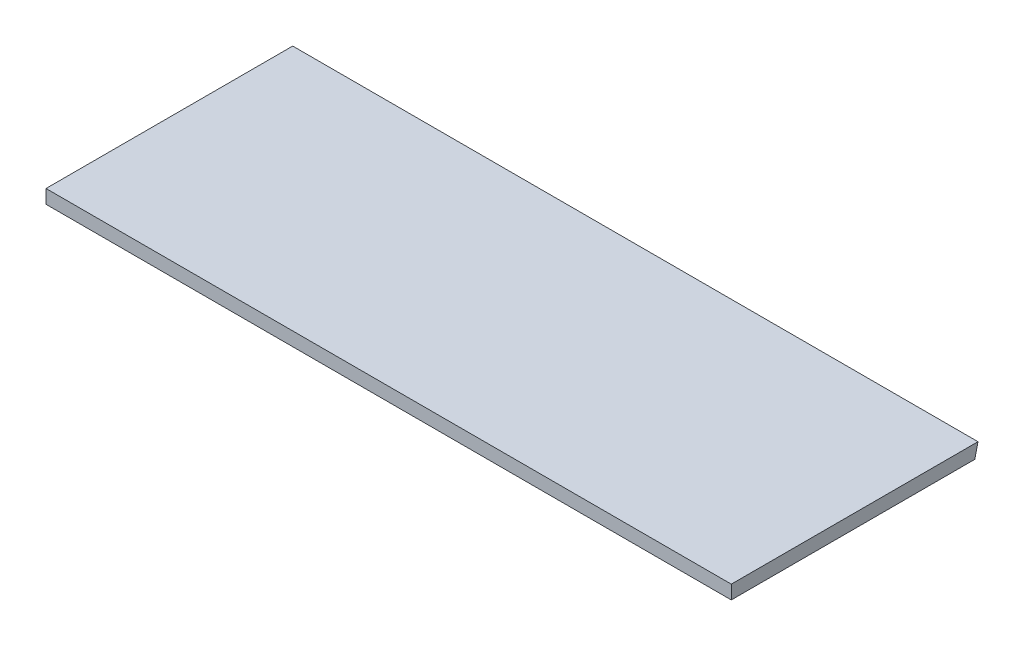
ISO-10303-21;
HEADER;
FILE_DESCRIPTION(('STEP AP214'),'2;1');
FILE_NAME('part.step','',(''),(''),'','','');
FILE_SCHEMA(('AUTOMOTIVE_DESIGN { 1 0 10303 214 1 1 1 1 }'));
ENDSEC;
DATA;
#1=APPLICATION_CONTEXT('core data for automotive mechanical design processes');
#2=APPLICATION_PROTOCOL_DEFINITION('international standard','automotive_design',2000,#1);
#3=PRODUCT_CONTEXT('',#1,'mechanical');
#4=PRODUCT('Part','Part','',(#3));
#5=PRODUCT_RELATED_PRODUCT_CATEGORY('part','',(#4));
#6=PRODUCT_DEFINITION_FORMATION('','',#4);
#7=PRODUCT_DEFINITION_CONTEXT('part definition',#1,'design');
#8=PRODUCT_DEFINITION('design','',#6,#7);
#9=PRODUCT_DEFINITION_SHAPE('','',#8);
#10=(LENGTH_UNIT() NAMED_UNIT(*) SI_UNIT(.MILLI.,.METRE.));
#11=(NAMED_UNIT(*) PLANE_ANGLE_UNIT() SI_UNIT($,.RADIAN.));
#12=(NAMED_UNIT(*) SI_UNIT($,.STERADIAN.) SOLID_ANGLE_UNIT());
#13=UNCERTAINTY_MEASURE_WITH_UNIT(LENGTH_MEASURE(1.E-05),#10,'distance_accuracy_value','');
#14=(GEOMETRIC_REPRESENTATION_CONTEXT(3) GLOBAL_UNCERTAINTY_ASSIGNED_CONTEXT((#13)) GLOBAL_UNIT_ASSIGNED_CONTEXT((#10,
#11,#12)) REPRESENTATION_CONTEXT('',''));
#15=CARTESIAN_POINT('',(0.,0.,0.));
#16=DIRECTION('',(0.,0.,1.));
#17=DIRECTION('',(1.,0.,0.));
#18=AXIS2_PLACEMENT_3D('',#15,#16,#17);
#19=CARTESIAN_POINT('',(250.,10.,90.));
#20=DIRECTION('',(-1.,0.,0.));
#21=DIRECTION('',(0.,0.,1.));
#22=AXIS2_PLACEMENT_3D('',#19,#20,#21);
#23=PLANE('',#22);
#24=DIRECTION('',(0.,0.,-1.));
#25=VECTOR('',#24,1.);
#26=CARTESIAN_POINT('',(250.,0.,90.));
#27=LINE('',#26,#25);
#28=CARTESIAN_POINT('',(250.,0.,90.));
#29=VERTEX_POINT('',#28);
#30=CARTESIAN_POINT('',(250.,0.,-87.6913180887443));
#31=VERTEX_POINT('',#30);
#32=EDGE_CURVE('E85',#29,#31,#27,.T.);
#33=ORIENTED_EDGE('',*,*,#32,.T.);
#34=DIRECTION('',(0.,-0.974370064785235,0.224951054343866));
#35=VECTOR('',#34,1.);
#36=CARTESIAN_POINT('',(250.,10.,-90.));
#37=LINE('',#36,#35);
#38=CARTESIAN_POINT('',(250.,10.,-90.));
#39=VERTEX_POINT('',#38);
#40=EDGE_CURVE('E51',#39,#31,#37,.T.);
#41=ORIENTED_EDGE('',*,*,#40,.F.);
#42=DIRECTION('',(0.,0.,-1.));
#43=VECTOR('',#42,1.);
#44=CARTESIAN_POINT('',(250.,10.,90.));
#45=LINE('',#44,#43);
#46=CARTESIAN_POINT('',(250.,10.,90.));
#47=VERTEX_POINT('',#46);
#48=EDGE_CURVE('E80',#47,#39,#45,.T.);
#49=ORIENTED_EDGE('',*,*,#48,.F.);
#50=DIRECTION('',(0.,-1.,0.));
#51=VECTOR('',#50,1.);
#52=CARTESIAN_POINT('',(250.,10.,90.));
#53=LINE('',#52,#51);
#54=EDGE_CURVE('E44',#47,#29,#53,.T.);
#55=ORIENTED_EDGE('',*,*,#54,.T.);
#56=EDGE_LOOP('',(#33,#41,#49,#55));
#57=FACE_BOUND('',#56,.T.);
#58=ADVANCED_FACE('F37',(#57),#23,.F.);
#59=CARTESIAN_POINT('',(-250.,10.,90.));
#60=DIRECTION('',(1.,0.,0.));
#61=DIRECTION('',(0.,0.,-1.));
#62=AXIS2_PLACEMENT_3D('',#59,#60,#61);
#63=PLANE('',#62);
#64=DIRECTION('',(0.,0.,1.));
#65=VECTOR('',#64,1.);
#66=CARTESIAN_POINT('',(-250.,10.,90.));
#67=LINE('',#66,#65);
#68=CARTESIAN_POINT('',(-250.,10.,-90.));
#69=VERTEX_POINT('',#68);
#70=CARTESIAN_POINT('',(-250.,10.,90.));
#71=VERTEX_POINT('',#70);
#72=EDGE_CURVE('E94',#69,#71,#67,.T.);
#73=ORIENTED_EDGE('',*,*,#72,.F.);
#74=DIRECTION('',(0.,-0.974370064785235,0.224951054343866));
#75=VECTOR('',#74,1.);
#76=CARTESIAN_POINT('',(-250.,10.,-90.));
#77=LINE('',#76,#75);
#78=CARTESIAN_POINT('',(-250.,0.,-87.6913180887443));
#79=VERTEX_POINT('',#78);
#80=EDGE_CURVE('E90',#69,#79,#77,.T.);
#81=ORIENTED_EDGE('',*,*,#80,.T.);
#82=DIRECTION('',(0.,0.,1.));
#83=VECTOR('',#82,1.);
#84=CARTESIAN_POINT('',(-250.,0.,90.));
#85=LINE('',#84,#83);
#86=CARTESIAN_POINT('',(-250.,0.,90.));
#87=VERTEX_POINT('',#86);
#88=EDGE_CURVE('E81',#79,#87,#85,.T.);
#89=ORIENTED_EDGE('',*,*,#88,.T.);
#90=DIRECTION('',(0.,-1.,0.));
#91=VECTOR('',#90,1.);
#92=CARTESIAN_POINT('',(-250.,10.,90.));
#93=LINE('',#92,#91);
#94=EDGE_CURVE('E11',#71,#87,#93,.T.);
#95=ORIENTED_EDGE('',*,*,#94,.F.);
#96=EDGE_LOOP('',(#73,#81,#89,#95));
#97=FACE_BOUND('',#96,.T.);
#98=ADVANCED_FACE('F105',(#97),#63,.F.);
#99=CARTESIAN_POINT('',(-250.,10.,90.));
#100=DIRECTION('',(0.,0.,-1.));
#101=DIRECTION('',(-1.,0.,0.));
#102=AXIS2_PLACEMENT_3D('',#99,#100,#101);
#103=PLANE('',#102);
#104=DIRECTION('',(1.,0.,0.));
#105=VECTOR('',#104,1.);
#106=CARTESIAN_POINT('',(-250.,0.,90.));
#107=LINE('',#106,#105);
#108=EDGE_CURVE('E72',#87,#29,#107,.T.);
#109=ORIENTED_EDGE('',*,*,#108,.T.);
#110=ORIENTED_EDGE('',*,*,#54,.F.);
#111=DIRECTION('',(1.,0.,0.));
#112=VECTOR('',#111,1.);
#113=CARTESIAN_POINT('',(-250.,10.,90.));
#114=LINE('',#113,#112);
#115=EDGE_CURVE('E60',#71,#47,#114,.T.);
#116=ORIENTED_EDGE('',*,*,#115,.F.);
#117=ORIENTED_EDGE('',*,*,#94,.T.);
#118=EDGE_LOOP('',(#109,#110,#116,#117));
#119=FACE_BOUND('',#118,.T.);
#120=ADVANCED_FACE('F74',(#119),#103,.F.);
#121=CARTESIAN_POINT('',(0.,10.,0.));
#122=DIRECTION('',(0.,-1.,0.));
#123=DIRECTION('',(0.,0.,-1.));
#124=AXIS2_PLACEMENT_3D('',#121,#122,#123);
#125=PLANE('',#124);
#126=ORIENTED_EDGE('',*,*,#48,.T.);
#127=DIRECTION('',(-1.,0.,0.));
#128=VECTOR('',#127,1.);
#129=CARTESIAN_POINT('',(-250.,10.,-90.));
#130=LINE('',#129,#128);
#131=EDGE_CURVE('E96',#39,#69,#130,.T.);
#132=ORIENTED_EDGE('',*,*,#131,.T.);
#133=ORIENTED_EDGE('',*,*,#72,.T.);
#134=ORIENTED_EDGE('',*,*,#115,.T.);
#135=EDGE_LOOP('',(#126,#132,#133,#134));
#136=FACE_BOUND('',#135,.T.);
#137=ADVANCED_FACE('F111',(#136),#125,.F.);
#138=CARTESIAN_POINT('',(0.,0.,0.));
#139=DIRECTION('',(0.,-1.,0.));
#140=DIRECTION('',(0.,0.,-1.));
#141=AXIS2_PLACEMENT_3D('',#138,#139,#140);
#142=PLANE('',#141);
#143=DIRECTION('',(1.,0.,0.));
#144=VECTOR('',#143,1.);
#145=CARTESIAN_POINT('',(-250.,0.,-87.6913180887443));
#146=LINE('',#145,#144);
#147=EDGE_CURVE('E87',#79,#31,#146,.T.);
#148=ORIENTED_EDGE('',*,*,#147,.T.);
#149=ORIENTED_EDGE('',*,*,#32,.F.);
#150=ORIENTED_EDGE('',*,*,#108,.F.);
#151=ORIENTED_EDGE('',*,*,#88,.F.);
#152=EDGE_LOOP('',(#148,#149,#150,#151));
#153=FACE_BOUND('',#152,.T.);
#154=ADVANCED_FACE('F86',(#153),#142,.T.);
#155=CARTESIAN_POINT('',(-250.,10.,-90.));
#156=DIRECTION('',(0.,0.224951054343866,0.974370064785235));
#157=DIRECTION('',(0.,-0.974370064785235,0.224951054343866));
#158=AXIS2_PLACEMENT_3D('',#155,#156,#157);
#159=PLANE('',#158);
#160=ORIENTED_EDGE('',*,*,#40,.T.);
#161=ORIENTED_EDGE('',*,*,#147,.F.);
#162=ORIENTED_EDGE('',*,*,#80,.F.);
#163=ORIENTED_EDGE('',*,*,#131,.F.);
#164=EDGE_LOOP('',(#160,#161,#162,#163));
#165=FACE_BOUND('',#164,.T.);
#166=ADVANCED_FACE('F108',(#165),#159,.F.);
#167=CLOSED_SHELL('',(#58,#98,#120,#137,#154,#166));
#168=MANIFOLD_SOLID_BREP('B2',#167);
#169=ADVANCED_BREP_SHAPE_REPRESENTATION('',(#18,#168),#14);
#170=SHAPE_DEFINITION_REPRESENTATION(#9,#169);
ENDSEC;
END-ISO-10303-21;
